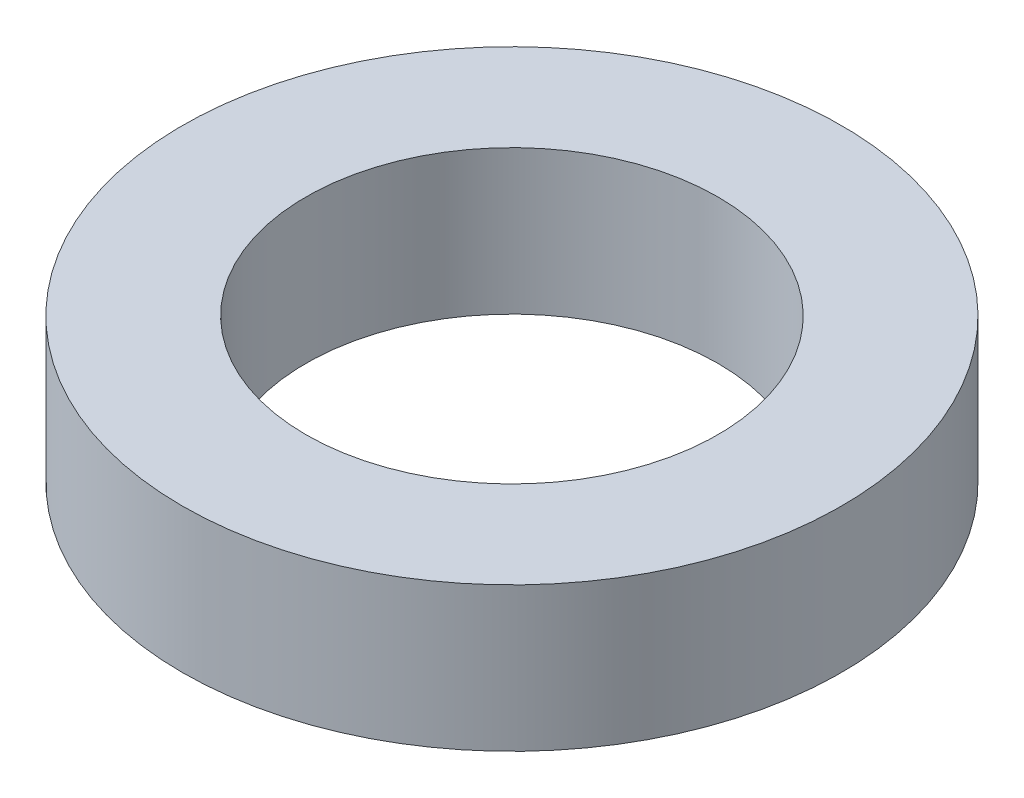
ISO-10303-21;
HEADER;
FILE_DESCRIPTION(('STEP AP214'),'2;1');
FILE_NAME('part.step','',(''),(''),'','','');
FILE_SCHEMA(('AUTOMOTIVE_DESIGN { 1 0 10303 214 1 1 1 1 }'));
ENDSEC;
DATA;
#1=APPLICATION_CONTEXT('core data for automotive mechanical design processes');
#2=APPLICATION_PROTOCOL_DEFINITION('international standard','automotive_design',2000,#1);
#3=PRODUCT_CONTEXT('',#1,'mechanical');
#4=PRODUCT('Part','Part','',(#3));
#5=PRODUCT_RELATED_PRODUCT_CATEGORY('part','',(#4));
#6=PRODUCT_DEFINITION_FORMATION('','',#4);
#7=PRODUCT_DEFINITION_CONTEXT('part definition',#1,'design');
#8=PRODUCT_DEFINITION('design','',#6,#7);
#9=PRODUCT_DEFINITION_SHAPE('','',#8);
#10=(LENGTH_UNIT() NAMED_UNIT(*) SI_UNIT(.MILLI.,.METRE.));
#11=(NAMED_UNIT(*) PLANE_ANGLE_UNIT() SI_UNIT($,.RADIAN.));
#12=(NAMED_UNIT(*) SI_UNIT($,.STERADIAN.) SOLID_ANGLE_UNIT());
#13=UNCERTAINTY_MEASURE_WITH_UNIT(LENGTH_MEASURE(1.E-05),#10,'distance_accuracy_value','');
#14=(GEOMETRIC_REPRESENTATION_CONTEXT(3) GLOBAL_UNCERTAINTY_ASSIGNED_CONTEXT((#13)) GLOBAL_UNIT_ASSIGNED_CONTEXT((#10,
#11,#12)) REPRESENTATION_CONTEXT('',''));
#15=CARTESIAN_POINT('',(0.,0.,0.));
#16=DIRECTION('',(0.,0.,1.));
#17=DIRECTION('',(1.,0.,0.));
#18=AXIS2_PLACEMENT_3D('',#15,#16,#17);
#19=CARTESIAN_POINT('',(0.,7.,0.));
#20=DIRECTION('',(0.,1.,0.));
#21=DIRECTION('',(0.,0.,1.));
#22=AXIS2_PLACEMENT_3D('',#19,#20,#21);
#23=PLANE('',#22);
#24=CARTESIAN_POINT('',(0.,7.,0.));
#25=DIRECTION('',(0.,1.,0.));
#26=DIRECTION('',(0.,0.,1.));
#27=AXIS2_PLACEMENT_3D('',#24,#25,#26);
#28=CIRCLE('',#27,16.);
#29=CARTESIAN_POINT('',(0.,7.,16.));
#30=VERTEX_POINT('',#29);
#31=EDGE_CURVE('E10',#30,#30,#28,.T.);
#32=ORIENTED_EDGE('',*,*,#31,.T.);
#33=EDGE_LOOP('',(#32));
#34=FACE_BOUND('',#33,.T.);
#35=CARTESIAN_POINT('',(0.,7.,0.));
#36=DIRECTION('',(0.,1.,0.));
#37=DIRECTION('',(0.,0.,1.));
#38=AXIS2_PLACEMENT_3D('',#35,#36,#37);
#39=CIRCLE('',#38,10.);
#40=CARTESIAN_POINT('',(0.,7.,10.));
#41=VERTEX_POINT('',#40);
#42=EDGE_CURVE('E42',#41,#41,#39,.T.);
#43=ORIENTED_EDGE('',*,*,#42,.F.);
#44=EDGE_LOOP('',(#43));
#45=FACE_BOUND('',#44,.T.);
#46=ADVANCED_FACE('F31',(#34,#45),#23,.T.);
#47=CARTESIAN_POINT('',(0.,0.,0.));
#48=DIRECTION('',(0.,1.,0.));
#49=DIRECTION('',(0.,0.,1.));
#50=AXIS2_PLACEMENT_3D('',#47,#48,#49);
#51=PLANE('',#50);
#52=CARTESIAN_POINT('',(0.,0.,0.));
#53=DIRECTION('',(0.,1.,0.));
#54=DIRECTION('',(0.,0.,1.));
#55=AXIS2_PLACEMENT_3D('',#52,#53,#54);
#56=CIRCLE('',#55,16.);
#57=CARTESIAN_POINT('',(0.,0.,16.));
#58=VERTEX_POINT('',#57);
#59=EDGE_CURVE('E35',#58,#58,#56,.T.);
#60=ORIENTED_EDGE('',*,*,#59,.F.);
#61=EDGE_LOOP('',(#60));
#62=FACE_BOUND('',#61,.T.);
#63=CARTESIAN_POINT('',(0.,0.,0.));
#64=DIRECTION('',(0.,1.,0.));
#65=DIRECTION('',(0.,0.,1.));
#66=AXIS2_PLACEMENT_3D('',#63,#64,#65);
#67=CIRCLE('',#66,10.);
#68=CARTESIAN_POINT('',(0.,0.,10.));
#69=VERTEX_POINT('',#68);
#70=EDGE_CURVE('E44',#69,#69,#67,.T.);
#71=ORIENTED_EDGE('',*,*,#70,.T.);
#72=EDGE_LOOP('',(#71));
#73=FACE_BOUND('',#72,.T.);
#74=ADVANCED_FACE('F54',(#62,#73),#51,.F.);
#75=CARTESIAN_POINT('',(0.,7.,0.));
#76=DIRECTION('',(0.,-1.,0.));
#77=DIRECTION('',(0.,0.,-1.));
#78=AXIS2_PLACEMENT_3D('',#75,#76,#77);
#79=CYLINDRICAL_SURFACE('',#78,16.);
#80=ORIENTED_EDGE('',*,*,#31,.F.);
#81=EDGE_LOOP('',(#80));
#82=FACE_BOUND('',#81,.T.);
#83=ORIENTED_EDGE('',*,*,#59,.T.);
#84=EDGE_LOOP('',(#83));
#85=FACE_BOUND('',#84,.T.);
#86=ADVANCED_FACE('F33',(#82,#85),#79,.T.);
#87=CARTESIAN_POINT('',(0.,7.,0.));
#88=DIRECTION('',(0.,-1.,0.));
#89=DIRECTION('',(0.,0.,-1.));
#90=AXIS2_PLACEMENT_3D('',#87,#88,#89);
#91=CYLINDRICAL_SURFACE('',#90,10.);
#92=ORIENTED_EDGE('',*,*,#42,.T.);
#93=EDGE_LOOP('',(#92));
#94=FACE_BOUND('',#93,.T.);
#95=ORIENTED_EDGE('',*,*,#70,.F.);
#96=EDGE_LOOP('',(#95));
#97=FACE_BOUND('',#96,.T.);
#98=ADVANCED_FACE('F50',(#94,#97),#91,.F.);
#99=CLOSED_SHELL('',(#46,#74,#86,#98));
#100=MANIFOLD_SOLID_BREP('B2',#99);
#101=ADVANCED_BREP_SHAPE_REPRESENTATION('',(#18,#100),#14);
#102=SHAPE_DEFINITION_REPRESENTATION(#9,#101);
ENDSEC;
END-ISO-10303-21;
